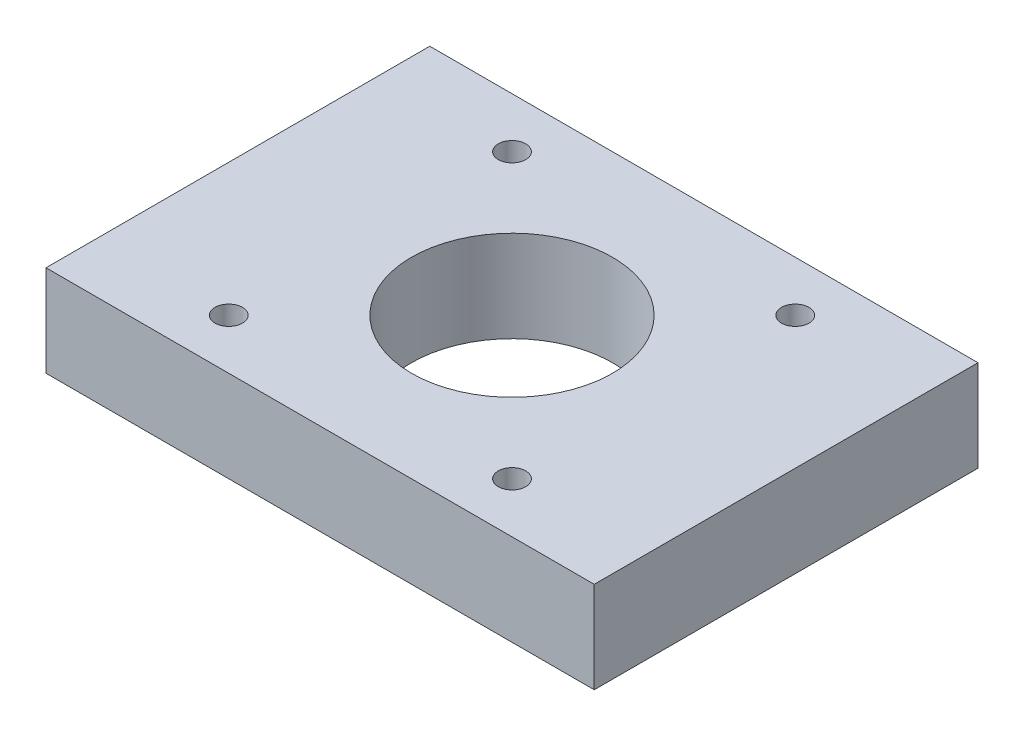
ISO-10303-21;
HEADER;
FILE_DESCRIPTION(('STEP AP214'),'2;1');
FILE_NAME('part.step','',(''),(''),'','','');
FILE_SCHEMA(('AUTOMOTIVE_DESIGN { 1 0 10303 214 1 1 1 1 }'));
ENDSEC;
DATA;
#1=APPLICATION_CONTEXT('core data for automotive mechanical design processes');
#2=APPLICATION_PROTOCOL_DEFINITION('international standard','automotive_design',2000,#1);
#3=PRODUCT_CONTEXT('',#1,'mechanical');
#4=PRODUCT('Part','Part','',(#3));
#5=PRODUCT_RELATED_PRODUCT_CATEGORY('part','',(#4));
#6=PRODUCT_DEFINITION_FORMATION('','',#4);
#7=PRODUCT_DEFINITION_CONTEXT('part definition',#1,'design');
#8=PRODUCT_DEFINITION('design','',#6,#7);
#9=PRODUCT_DEFINITION_SHAPE('','',#8);
#10=(LENGTH_UNIT() NAMED_UNIT(*) SI_UNIT(.MILLI.,.METRE.));
#11=(NAMED_UNIT(*) PLANE_ANGLE_UNIT() SI_UNIT($,.RADIAN.));
#12=(NAMED_UNIT(*) SI_UNIT($,.STERADIAN.) SOLID_ANGLE_UNIT());
#13=UNCERTAINTY_MEASURE_WITH_UNIT(LENGTH_MEASURE(1.E-05),#10,'distance_accuracy_value','');
#14=(GEOMETRIC_REPRESENTATION_CONTEXT(3) GLOBAL_UNCERTAINTY_ASSIGNED_CONTEXT((#13)) GLOBAL_UNIT_ASSIGNED_CONTEXT((#10,
#11,#12)) REPRESENTATION_CONTEXT('',''));
#15=CARTESIAN_POINT('',(0.,0.,0.));
#16=DIRECTION('',(0.,0.,1.));
#17=DIRECTION('',(1.,0.,0.));
#18=AXIS2_PLACEMENT_3D('',#15,#16,#17);
#19=CARTESIAN_POINT('',(-15.5000000000009,52.7714550450981,36.5));
#20=DIRECTION('',(0.,1.,0.));
#21=DIRECTION('',(0.,0.,1.));
#22=AXIS2_PLACEMENT_3D('',#19,#20,#21);
#23=CYLINDRICAL_SURFACE('',#22,1.50000000000041);
#24=CARTESIAN_POINT('',(-15.5000000000009,62.7714550450981,36.5));
#25=DIRECTION('',(0.,1.,0.));
#26=DIRECTION('',(0.,0.,1.));
#27=AXIS2_PLACEMENT_3D('',#24,#25,#26);
#28=CIRCLE('',#27,1.50000000000041);
#29=CARTESIAN_POINT('',(-15.5000000000009,62.7714550450981,38.0000000000004));
#30=VERTEX_POINT('',#29);
#31=EDGE_CURVE('E141',#30,#30,#28,.T.);
#32=ORIENTED_EDGE('',*,*,#31,.T.);
#33=EDGE_LOOP('',(#32));
#34=FACE_BOUND('',#33,.T.);
#35=CARTESIAN_POINT('',(-15.5000000000009,55.7714550450981,36.5));
#36=DIRECTION('',(0.,-1.,0.));
#37=DIRECTION('',(0.,0.,-1.));
#38=AXIS2_PLACEMENT_3D('',#35,#36,#37);
#39=CIRCLE('',#38,1.50000000000041);
#40=CARTESIAN_POINT('',(-15.5000000000009,55.7714550450981,34.9999999999996));
#41=VERTEX_POINT('',#40);
#42=EDGE_CURVE('E41',#41,#41,#39,.F.);
#43=ORIENTED_EDGE('',*,*,#42,.F.);
#44=EDGE_LOOP('',(#43));
#45=FACE_BOUND('',#44,.T.);
#46=ADVANCED_FACE('F37',(#34,#45),#23,.F.);
#47=CARTESIAN_POINT('',(15.4999999999991,52.7714550450981,36.5));
#48=DIRECTION('',(0.,1.,0.));
#49=DIRECTION('',(0.,0.,1.));
#50=AXIS2_PLACEMENT_3D('',#47,#48,#49);
#51=CYLINDRICAL_SURFACE('',#50,1.5000000000004);
#52=CARTESIAN_POINT('',(15.4999999999991,62.7714550450981,36.5));
#53=DIRECTION('',(0.,1.,0.));
#54=DIRECTION('',(0.,0.,1.));
#55=AXIS2_PLACEMENT_3D('',#52,#53,#54);
#56=CIRCLE('',#55,1.5000000000004);
#57=CARTESIAN_POINT('',(15.4999999999991,62.7714550450981,38.0000000000004));
#58=VERTEX_POINT('',#57);
#59=EDGE_CURVE('E133',#58,#58,#56,.T.);
#60=ORIENTED_EDGE('',*,*,#59,.T.);
#61=EDGE_LOOP('',(#60));
#62=FACE_BOUND('',#61,.T.);
#63=CARTESIAN_POINT('',(15.4999999999991,55.7714550450981,36.5));
#64=DIRECTION('',(0.,-1.,0.));
#65=DIRECTION('',(0.,0.,-1.));
#66=AXIS2_PLACEMENT_3D('',#63,#64,#65);
#67=CIRCLE('',#66,1.5000000000004);
#68=CARTESIAN_POINT('',(15.4999999999991,55.7714550450981,34.9999999999996));
#69=VERTEX_POINT('',#68);
#70=EDGE_CURVE('E119',#69,#69,#67,.F.);
#71=ORIENTED_EDGE('',*,*,#70,.F.);
#72=EDGE_LOOP('',(#71));
#73=FACE_BOUND('',#72,.T.);
#74=ADVANCED_FACE('F208',(#62,#73),#51,.F.);
#75=CARTESIAN_POINT('',(-15.5000000000009,52.7714550450981,5.50000000000001));
#76=DIRECTION('',(0.,1.,0.));
#77=DIRECTION('',(0.,0.,1.));
#78=AXIS2_PLACEMENT_3D('',#75,#76,#77);
#79=CYLINDRICAL_SURFACE('',#78,1.50000000000041);
#80=CARTESIAN_POINT('',(-15.5000000000009,62.7714550450981,5.50000000000001));
#81=DIRECTION('',(0.,1.,0.));
#82=DIRECTION('',(0.,0.,1.));
#83=AXIS2_PLACEMENT_3D('',#80,#81,#82);
#84=CIRCLE('',#83,1.50000000000041);
#85=CARTESIAN_POINT('',(-15.5000000000009,62.7714550450981,7.00000000000042));
#86=VERTEX_POINT('',#85);
#87=EDGE_CURVE('E128',#86,#86,#84,.T.);
#88=ORIENTED_EDGE('',*,*,#87,.T.);
#89=EDGE_LOOP('',(#88));
#90=FACE_BOUND('',#89,.T.);
#91=CARTESIAN_POINT('',(-15.5000000000009,55.7714550450981,5.50000000000001));
#92=DIRECTION('',(0.,-1.,0.));
#93=DIRECTION('',(0.,0.,-1.));
#94=AXIS2_PLACEMENT_3D('',#91,#92,#93);
#95=CIRCLE('',#94,1.50000000000041);
#96=CARTESIAN_POINT('',(-15.5000000000009,55.7714550450981,3.99999999999961));
#97=VERTEX_POINT('',#96);
#98=EDGE_CURVE('E116',#97,#97,#95,.F.);
#99=ORIENTED_EDGE('',*,*,#98,.F.);
#100=EDGE_LOOP('',(#99));
#101=FACE_BOUND('',#100,.T.);
#102=ADVANCED_FACE('F213',(#90,#101),#79,.F.);
#103=CARTESIAN_POINT('',(15.4999999999991,52.7714550450981,5.50000000000001));
#104=DIRECTION('',(0.,1.,0.));
#105=DIRECTION('',(0.,0.,1.));
#106=AXIS2_PLACEMENT_3D('',#103,#104,#105);
#107=CYLINDRICAL_SURFACE('',#106,1.50000000000041);
#108=CARTESIAN_POINT('',(15.4999999999991,62.7714550450981,5.50000000000001));
#109=DIRECTION('',(0.,1.,0.));
#110=DIRECTION('',(0.,0.,1.));
#111=AXIS2_PLACEMENT_3D('',#108,#109,#110);
#112=CIRCLE('',#111,1.50000000000041);
#113=CARTESIAN_POINT('',(15.4999999999991,62.7714550450981,7.00000000000042));
#114=VERTEX_POINT('',#113);
#115=EDGE_CURVE('E124',#114,#114,#112,.T.);
#116=ORIENTED_EDGE('',*,*,#115,.T.);
#117=EDGE_LOOP('',(#116));
#118=FACE_BOUND('',#117,.T.);
#119=CARTESIAN_POINT('',(15.4999999999991,55.7714550450981,5.50000000000001));
#120=DIRECTION('',(0.,-1.,0.));
#121=DIRECTION('',(0.,0.,-1.));
#122=AXIS2_PLACEMENT_3D('',#119,#120,#121);
#123=CIRCLE('',#122,1.50000000000041);
#124=CARTESIAN_POINT('',(15.4999999999991,55.7714550450981,3.99999999999961));
#125=VERTEX_POINT('',#124);
#126=EDGE_CURVE('E113',#125,#125,#123,.F.);
#127=ORIENTED_EDGE('',*,*,#126,.F.);
#128=EDGE_LOOP('',(#127));
#129=FACE_BOUND('',#128,.T.);
#130=ADVANCED_FACE('F222',(#118,#129),#107,.F.);
#131=CARTESIAN_POINT('',(-30.,62.7714550450981,42.));
#132=DIRECTION('',(1.,0.,0.));
#133=DIRECTION('',(0.,1.,0.));
#134=AXIS2_PLACEMENT_3D('',#131,#132,#133);
#135=PLANE('',#134);
#136=DIRECTION('',(0.,-1.,0.));
#137=VECTOR('',#136,1.);
#138=CARTESIAN_POINT('',(-30.,62.7714550450981,0.));
#139=LINE('',#138,#137);
#140=CARTESIAN_POINT('',(-30.,62.7714550450981,0.));
#141=VERTEX_POINT('',#140);
#142=CARTESIAN_POINT('',(-30.,52.7714550450981,0.));
#143=VERTEX_POINT('',#142);
#144=EDGE_CURVE('E104',#141,#143,#139,.T.);
#145=ORIENTED_EDGE('',*,*,#144,.T.);
#146=DIRECTION('',(0.,0.,-1.));
#147=VECTOR('',#146,1.);
#148=CARTESIAN_POINT('',(-30.,52.7714550450981,42.));
#149=LINE('',#148,#147);
#150=CARTESIAN_POINT('',(-30.,52.7714550450981,42.));
#151=VERTEX_POINT('',#150);
#152=EDGE_CURVE('E11',#151,#143,#149,.T.);
#153=ORIENTED_EDGE('',*,*,#152,.F.);
#154=DIRECTION('',(0.,-1.,0.));
#155=VECTOR('',#154,1.);
#156=CARTESIAN_POINT('',(-30.,62.7714550450981,42.));
#157=LINE('',#156,#155);
#158=CARTESIAN_POINT('',(-30.,62.7714550450981,42.));
#159=VERTEX_POINT('',#158);
#160=EDGE_CURVE('E91',#159,#151,#157,.T.);
#161=ORIENTED_EDGE('',*,*,#160,.F.);
#162=DIRECTION('',(0.,0.,-1.));
#163=VECTOR('',#162,1.);
#164=CARTESIAN_POINT('',(-30.,62.7714550450981,42.));
#165=LINE('',#164,#163);
#166=EDGE_CURVE('E100',#159,#141,#165,.T.);
#167=ORIENTED_EDGE('',*,*,#166,.T.);
#168=EDGE_LOOP('',(#145,#153,#161,#167));
#169=FACE_BOUND('',#168,.T.);
#170=ADVANCED_FACE('F39',(#169),#135,.F.);
#171=CARTESIAN_POINT('',(-30.,52.7714550450981,42.));
#172=DIRECTION('',(0.,1.,0.));
#173=DIRECTION('',(0.,0.,1.));
#174=AXIS2_PLACEMENT_3D('',#171,#172,#173);
#175=PLANE('',#174);
#176=CARTESIAN_POINT('',(-15.5000000000009,52.7714550450981,5.50000000000001));
#177=DIRECTION('',(0.,-1.,0.));
#178=DIRECTION('',(0.,0.,-1.));
#179=AXIS2_PLACEMENT_3D('',#176,#177,#178);
#180=CIRCLE('',#179,2.85);
#181=CARTESIAN_POINT('',(-15.5000000000009,52.7714550450981,2.65000000000001));
#182=VERTEX_POINT('',#181);
#183=EDGE_CURVE('E156',#182,#182,#180,.T.);
#184=ORIENTED_EDGE('',*,*,#183,.F.);
#185=EDGE_LOOP('',(#184));
#186=FACE_BOUND('',#185,.T.);
#187=CARTESIAN_POINT('',(15.4999999999991,52.7714550450981,5.50000000000001));
#188=DIRECTION('',(0.,-1.,0.));
#189=DIRECTION('',(0.,0.,-1.));
#190=AXIS2_PLACEMENT_3D('',#187,#188,#189);
#191=CIRCLE('',#190,2.85);
#192=CARTESIAN_POINT('',(15.4999999999991,52.7714550450981,2.65000000000001));
#193=VERTEX_POINT('',#192);
#194=EDGE_CURVE('E162',#193,#193,#191,.T.);
#195=ORIENTED_EDGE('',*,*,#194,.F.);
#196=EDGE_LOOP('',(#195));
#197=FACE_BOUND('',#196,.T.);
#198=CARTESIAN_POINT('',(15.4999999999991,52.7714550450981,36.5));
#199=DIRECTION('',(0.,-1.,0.));
#200=DIRECTION('',(0.,0.,-1.));
#201=AXIS2_PLACEMENT_3D('',#198,#199,#200);
#202=CIRCLE('',#201,2.85);
#203=CARTESIAN_POINT('',(15.4999999999991,52.7714550450981,33.65));
#204=VERTEX_POINT('',#203);
#205=EDGE_CURVE('E168',#204,#204,#202,.T.);
#206=ORIENTED_EDGE('',*,*,#205,.F.);
#207=EDGE_LOOP('',(#206));
#208=FACE_BOUND('',#207,.T.);
#209=CARTESIAN_POINT('',(-15.5000000000009,52.7714550450981,36.5));
#210=DIRECTION('',(0.,-1.,0.));
#211=DIRECTION('',(0.,0.,-1.));
#212=AXIS2_PLACEMENT_3D('',#209,#210,#211);
#213=CIRCLE('',#212,2.85);
#214=CARTESIAN_POINT('',(-15.5000000000009,52.7714550450981,33.65));
#215=VERTEX_POINT('',#214);
#216=EDGE_CURVE('E150',#215,#215,#213,.T.);
#217=ORIENTED_EDGE('',*,*,#216,.F.);
#218=EDGE_LOOP('',(#217));
#219=FACE_BOUND('',#218,.T.);
#220=CARTESIAN_POINT('',(-8.46061610324645E-13,52.7714550450981,21.));
#221=DIRECTION('',(0.,1.,0.));
#222=DIRECTION('',(0.,0.,1.));
#223=AXIS2_PLACEMENT_3D('',#220,#221,#222);
#224=CIRCLE('',#223,11.0000000000004);
#225=CARTESIAN_POINT('',(-8.46061610324645E-13,52.7714550450981,32.0000000000004));
#226=VERTEX_POINT('',#225);
#227=EDGE_CURVE('E107',#226,#226,#224,.T.);
#228=ORIENTED_EDGE('',*,*,#227,.T.);
#229=EDGE_LOOP('',(#228));
#230=FACE_BOUND('',#229,.T.);
#231=DIRECTION('',(1.,0.,0.));
#232=VECTOR('',#231,1.);
#233=CARTESIAN_POINT('',(-30.,52.7714550450981,0.));
#234=LINE('',#233,#232);
#235=CARTESIAN_POINT('',(30.,52.7714550450981,0.));
#236=VERTEX_POINT('',#235);
#237=EDGE_CURVE('E95',#143,#236,#234,.T.);
#238=ORIENTED_EDGE('',*,*,#237,.T.);
#239=DIRECTION('',(0.,0.,-1.));
#240=VECTOR('',#239,1.);
#241=CARTESIAN_POINT('',(30.,52.7714550450981,42.));
#242=LINE('',#241,#240);
#243=CARTESIAN_POINT('',(30.,52.7714550450981,42.));
#244=VERTEX_POINT('',#243);
#245=EDGE_CURVE('E47',#244,#236,#242,.T.);
#246=ORIENTED_EDGE('',*,*,#245,.F.);
#247=DIRECTION('',(1.,0.,0.));
#248=VECTOR('',#247,1.);
#249=CARTESIAN_POINT('',(-30.,52.7714550450981,42.));
#250=LINE('',#249,#248);
#251=EDGE_CURVE('E86',#151,#244,#250,.T.);
#252=ORIENTED_EDGE('',*,*,#251,.F.);
#253=ORIENTED_EDGE('',*,*,#152,.T.);
#254=EDGE_LOOP('',(#238,#246,#252,#253));
#255=FACE_BOUND('',#254,.T.);
#256=ADVANCED_FACE('F94',(#186,#197,#208,#219,#230,#255),#175,.F.);
#257=CARTESIAN_POINT('',(30.,62.7714550450981,42.));
#258=DIRECTION('',(-1.,0.,0.));
#259=DIRECTION('',(0.,-1.,0.));
#260=AXIS2_PLACEMENT_3D('',#257,#258,#259);
#261=PLANE('',#260);
#262=DIRECTION('',(0.,1.,0.));
#263=VECTOR('',#262,1.);
#264=CARTESIAN_POINT('',(30.,62.7714550450981,0.));
#265=LINE('',#264,#263);
#266=CARTESIAN_POINT('',(30.,62.7714550450981,0.));
#267=VERTEX_POINT('',#266);
#268=EDGE_CURVE('E73',#236,#267,#265,.T.);
#269=ORIENTED_EDGE('',*,*,#268,.T.);
#270=DIRECTION('',(0.,0.,-1.));
#271=VECTOR('',#270,1.);
#272=CARTESIAN_POINT('',(30.,62.7714550450981,42.));
#273=LINE('',#272,#271);
#274=CARTESIAN_POINT('',(30.,62.7714550450981,42.));
#275=VERTEX_POINT('',#274);
#276=EDGE_CURVE('E96',#275,#267,#273,.T.);
#277=ORIENTED_EDGE('',*,*,#276,.F.);
#278=DIRECTION('',(0.,1.,0.));
#279=VECTOR('',#278,1.);
#280=CARTESIAN_POINT('',(30.,62.7714550450981,42.));
#281=LINE('',#280,#279);
#282=EDGE_CURVE('E89',#244,#275,#281,.T.);
#283=ORIENTED_EDGE('',*,*,#282,.F.);
#284=ORIENTED_EDGE('',*,*,#245,.T.);
#285=EDGE_LOOP('',(#269,#277,#283,#284));
#286=FACE_BOUND('',#285,.T.);
#287=ADVANCED_FACE('F98',(#286),#261,.F.);
#288=CARTESIAN_POINT('',(-30.,62.7714550450981,42.));
#289=DIRECTION('',(0.,-1.,0.));
#290=DIRECTION('',(0.,0.,-1.));
#291=AXIS2_PLACEMENT_3D('',#288,#289,#290);
#292=PLANE('',#291);
#293=ORIENTED_EDGE('',*,*,#115,.F.);
#294=EDGE_LOOP('',(#293));
#295=FACE_BOUND('',#294,.T.);
#296=ORIENTED_EDGE('',*,*,#87,.F.);
#297=EDGE_LOOP('',(#296));
#298=FACE_BOUND('',#297,.T.);
#299=ORIENTED_EDGE('',*,*,#59,.F.);
#300=EDGE_LOOP('',(#299));
#301=FACE_BOUND('',#300,.T.);
#302=ORIENTED_EDGE('',*,*,#31,.F.);
#303=EDGE_LOOP('',(#302));
#304=FACE_BOUND('',#303,.T.);
#305=CARTESIAN_POINT('',(-8.46061610324645E-13,62.7714550450981,21.));
#306=DIRECTION('',(0.,1.,0.));
#307=DIRECTION('',(0.,0.,1.));
#308=AXIS2_PLACEMENT_3D('',#305,#306,#307);
#309=CIRCLE('',#308,11.0000000000004);
#310=CARTESIAN_POINT('',(-8.46061610324645E-13,62.7714550450981,32.0000000000004));
#311=VERTEX_POINT('',#310);
#312=EDGE_CURVE('E139',#311,#311,#309,.T.);
#313=ORIENTED_EDGE('',*,*,#312,.F.);
#314=EDGE_LOOP('',(#313));
#315=FACE_BOUND('',#314,.T.);
#316=DIRECTION('',(-1.,0.,0.));
#317=VECTOR('',#316,1.);
#318=CARTESIAN_POINT('',(-30.,62.7714550450981,0.));
#319=LINE('',#318,#317);
#320=EDGE_CURVE('E79',#267,#141,#319,.T.);
#321=ORIENTED_EDGE('',*,*,#320,.T.);
#322=ORIENTED_EDGE('',*,*,#166,.F.);
#323=DIRECTION('',(-1.,0.,0.));
#324=VECTOR('',#323,1.);
#325=CARTESIAN_POINT('',(-30.,62.7714550450981,42.));
#326=LINE('',#325,#324);
#327=EDGE_CURVE('E56',#275,#159,#326,.T.);
#328=ORIENTED_EDGE('',*,*,#327,.F.);
#329=ORIENTED_EDGE('',*,*,#276,.T.);
#330=EDGE_LOOP('',(#321,#322,#328,#329));
#331=FACE_BOUND('',#330,.T.);
#332=ADVANCED_FACE('F236',(#295,#298,#301,#304,#315,#331),#292,.F.);
#333=CARTESIAN_POINT('',(0.,0.,42.));
#334=DIRECTION('',(0.,0.,1.));
#335=DIRECTION('',(1.,0.,0.));
#336=AXIS2_PLACEMENT_3D('',#333,#334,#335);
#337=PLANE('',#336);
#338=ORIENTED_EDGE('',*,*,#160,.T.);
#339=ORIENTED_EDGE('',*,*,#251,.T.);
#340=ORIENTED_EDGE('',*,*,#282,.T.);
#341=ORIENTED_EDGE('',*,*,#327,.T.);
#342=EDGE_LOOP('',(#338,#339,#340,#341));
#343=FACE_BOUND('',#342,.T.);
#344=ADVANCED_FACE('F87',(#343),#337,.T.);
#345=CARTESIAN_POINT('',(0.,0.,0.));
#346=DIRECTION('',(0.,0.,1.));
#347=DIRECTION('',(1.,0.,0.));
#348=AXIS2_PLACEMENT_3D('',#345,#346,#347);
#349=PLANE('',#348);
#350=ORIENTED_EDGE('',*,*,#144,.F.);
#351=ORIENTED_EDGE('',*,*,#320,.F.);
#352=ORIENTED_EDGE('',*,*,#268,.F.);
#353=ORIENTED_EDGE('',*,*,#237,.F.);
#354=EDGE_LOOP('',(#350,#351,#352,#353));
#355=FACE_BOUND('',#354,.T.);
#356=ADVANCED_FACE('F193',(#355),#349,.F.);
#357=CARTESIAN_POINT('',(-8.46061610324645E-13,52.7714550450981,21.));
#358=DIRECTION('',(0.,1.,0.));
#359=DIRECTION('',(0.,0.,1.));
#360=AXIS2_PLACEMENT_3D('',#357,#358,#359);
#361=CYLINDRICAL_SURFACE('',#360,11.0000000000004);
#362=ORIENTED_EDGE('',*,*,#227,.F.);
#363=EDGE_LOOP('',(#362));
#364=FACE_BOUND('',#363,.T.);
#365=ORIENTED_EDGE('',*,*,#312,.T.);
#366=EDGE_LOOP('',(#365));
#367=FACE_BOUND('',#366,.T.);
#368=ADVANCED_FACE('F190',(#364,#367),#361,.F.);
#369=CARTESIAN_POINT('',(15.4999999999991,55.7714550450981,5.50000000000001));
#370=DIRECTION('',(0.,-1.,0.));
#371=DIRECTION('',(0.,0.,-1.));
#372=AXIS2_PLACEMENT_3D('',#369,#370,#371);
#373=PLANE('',#372);
#374=CARTESIAN_POINT('',(15.4999999999991,55.7714550450981,5.50000000000001));
#375=DIRECTION('',(0.,-1.,0.));
#376=DIRECTION('',(0.,0.,-1.));
#377=AXIS2_PLACEMENT_3D('',#374,#375,#376);
#378=CIRCLE('',#377,2.85);
#379=CARTESIAN_POINT('',(15.4999999999991,55.7714550450981,2.65000000000001));
#380=VERTEX_POINT('',#379);
#381=EDGE_CURVE('E165',#380,#380,#378,.T.);
#382=ORIENTED_EDGE('',*,*,#381,.T.);
#383=EDGE_LOOP('',(#382));
#384=FACE_BOUND('',#383,.T.);
#385=ORIENTED_EDGE('',*,*,#126,.T.);
#386=EDGE_LOOP('',(#385));
#387=FACE_BOUND('',#386,.T.);
#388=ADVANCED_FACE('F192',(#384,#387),#373,.T.);
#389=CARTESIAN_POINT('',(15.4999999999991,55.7714550450981,5.50000000000001));
#390=DIRECTION('',(0.,-1.,0.));
#391=DIRECTION('',(0.,0.,-1.));
#392=AXIS2_PLACEMENT_3D('',#389,#390,#391);
#393=CYLINDRICAL_SURFACE('',#392,2.85);
#394=ORIENTED_EDGE('',*,*,#381,.F.);
#395=EDGE_LOOP('',(#394));
#396=FACE_BOUND('',#395,.T.);
#397=ORIENTED_EDGE('',*,*,#194,.T.);
#398=EDGE_LOOP('',(#397));
#399=FACE_BOUND('',#398,.T.);
#400=ADVANCED_FACE('F200',(#396,#399),#393,.F.);
#401=CARTESIAN_POINT('',(-15.5000000000009,55.7714550450981,5.50000000000001));
#402=DIRECTION('',(0.,-1.,0.));
#403=DIRECTION('',(0.,0.,-1.));
#404=AXIS2_PLACEMENT_3D('',#401,#402,#403);
#405=PLANE('',#404);
#406=CARTESIAN_POINT('',(-15.5000000000009,55.7714550450981,5.50000000000001));
#407=DIRECTION('',(0.,-1.,0.));
#408=DIRECTION('',(0.,0.,-1.));
#409=AXIS2_PLACEMENT_3D('',#406,#407,#408);
#410=CIRCLE('',#409,2.85);
#411=CARTESIAN_POINT('',(-15.5000000000009,55.7714550450981,2.65000000000001));
#412=VERTEX_POINT('',#411);
#413=EDGE_CURVE('E159',#412,#412,#410,.T.);
#414=ORIENTED_EDGE('',*,*,#413,.T.);
#415=EDGE_LOOP('',(#414));
#416=FACE_BOUND('',#415,.T.);
#417=ORIENTED_EDGE('',*,*,#98,.T.);
#418=EDGE_LOOP('',(#417));
#419=FACE_BOUND('',#418,.T.);
#420=ADVANCED_FACE('F255',(#416,#419),#405,.T.);
#421=CARTESIAN_POINT('',(-15.5000000000009,55.7714550450981,5.50000000000001));
#422=DIRECTION('',(0.,-1.,0.));
#423=DIRECTION('',(0.,0.,-1.));
#424=AXIS2_PLACEMENT_3D('',#421,#422,#423);
#425=CYLINDRICAL_SURFACE('',#424,2.85);
#426=ORIENTED_EDGE('',*,*,#413,.F.);
#427=EDGE_LOOP('',(#426));
#428=FACE_BOUND('',#427,.T.);
#429=ORIENTED_EDGE('',*,*,#183,.T.);
#430=EDGE_LOOP('',(#429));
#431=FACE_BOUND('',#430,.T.);
#432=ADVANCED_FACE('F257',(#428,#431),#425,.F.);
#433=CARTESIAN_POINT('',(15.4999999999991,55.7714550450981,36.5));
#434=DIRECTION('',(0.,-1.,0.));
#435=DIRECTION('',(0.,0.,-1.));
#436=AXIS2_PLACEMENT_3D('',#433,#434,#435);
#437=PLANE('',#436);
#438=CARTESIAN_POINT('',(15.4999999999991,55.7714550450981,36.5));
#439=DIRECTION('',(0.,-1.,0.));
#440=DIRECTION('',(0.,0.,-1.));
#441=AXIS2_PLACEMENT_3D('',#438,#439,#440);
#442=CIRCLE('',#441,2.85);
#443=CARTESIAN_POINT('',(15.4999999999991,55.7714550450981,33.65));
#444=VERTEX_POINT('',#443);
#445=EDGE_CURVE('E153',#444,#444,#442,.T.);
#446=ORIENTED_EDGE('',*,*,#445,.T.);
#447=EDGE_LOOP('',(#446));
#448=FACE_BOUND('',#447,.T.);
#449=ORIENTED_EDGE('',*,*,#70,.T.);
#450=EDGE_LOOP('',(#449));
#451=FACE_BOUND('',#450,.T.);
#452=ADVANCED_FACE('F174',(#448,#451),#437,.T.);
#453=CARTESIAN_POINT('',(15.4999999999991,55.7714550450981,36.5));
#454=DIRECTION('',(0.,-1.,0.));
#455=DIRECTION('',(0.,0.,-1.));
#456=AXIS2_PLACEMENT_3D('',#453,#454,#455);
#457=CYLINDRICAL_SURFACE('',#456,2.85);
#458=ORIENTED_EDGE('',*,*,#445,.F.);
#459=EDGE_LOOP('',(#458));
#460=FACE_BOUND('',#459,.T.);
#461=ORIENTED_EDGE('',*,*,#205,.T.);
#462=EDGE_LOOP('',(#461));
#463=FACE_BOUND('',#462,.T.);
#464=ADVANCED_FACE('F176',(#460,#463),#457,.F.);
#465=CARTESIAN_POINT('',(-15.5000000000009,55.7714550450981,36.5));
#466=DIRECTION('',(0.,-1.,0.));
#467=DIRECTION('',(0.,0.,-1.));
#468=AXIS2_PLACEMENT_3D('',#465,#466,#467);
#469=PLANE('',#468);
#470=CARTESIAN_POINT('',(-15.5000000000009,55.7714550450981,36.5));
#471=DIRECTION('',(0.,-1.,0.));
#472=DIRECTION('',(0.,0.,-1.));
#473=AXIS2_PLACEMENT_3D('',#470,#471,#472);
#474=CIRCLE('',#473,2.85);
#475=CARTESIAN_POINT('',(-15.5000000000009,55.7714550450981,33.65));
#476=VERTEX_POINT('',#475);
#477=EDGE_CURVE('E117',#476,#476,#474,.T.);
#478=ORIENTED_EDGE('',*,*,#477,.T.);
#479=EDGE_LOOP('',(#478));
#480=FACE_BOUND('',#479,.T.);
#481=ORIENTED_EDGE('',*,*,#42,.T.);
#482=EDGE_LOOP('',(#481));
#483=FACE_BOUND('',#482,.T.);
#484=ADVANCED_FACE('F179',(#480,#483),#469,.T.);
#485=CARTESIAN_POINT('',(-15.5000000000009,55.7714550450981,36.5));
#486=DIRECTION('',(0.,-1.,0.));
#487=DIRECTION('',(0.,0.,-1.));
#488=AXIS2_PLACEMENT_3D('',#485,#486,#487);
#489=CYLINDRICAL_SURFACE('',#488,2.85);
#490=ORIENTED_EDGE('',*,*,#477,.F.);
#491=EDGE_LOOP('',(#490));
#492=FACE_BOUND('',#491,.T.);
#493=ORIENTED_EDGE('',*,*,#216,.T.);
#494=EDGE_LOOP('',(#493));
#495=FACE_BOUND('',#494,.T.);
#496=ADVANCED_FACE('F218',(#492,#495),#489,.F.);
#497=CLOSED_SHELL('',(#46,#74,#102,#130,#170,#256,#287,#332,#344,#356,#368,#388,#400,#420,#432,
#452,#464,#484,#496));
#498=MANIFOLD_SOLID_BREP('B2',#497);
#499=ADVANCED_BREP_SHAPE_REPRESENTATION('',(#18,#498),#14);
#500=SHAPE_DEFINITION_REPRESENTATION(#9,#499);
ENDSEC;
END-ISO-10303-21;
